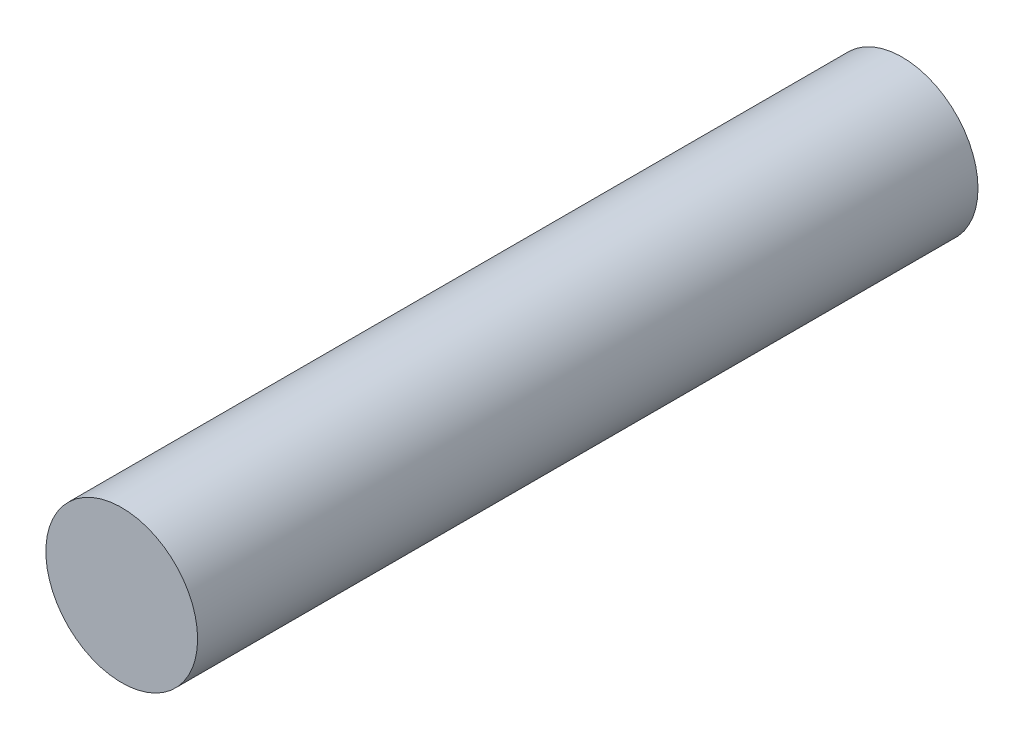
ISO-10303-21;
HEADER;
FILE_DESCRIPTION(('STEP AP214'),'2;1');
FILE_NAME('part.step','',(''),(''),'','','');
FILE_SCHEMA(('AUTOMOTIVE_DESIGN { 1 0 10303 214 1 1 1 1 }'));
ENDSEC;
DATA;
#1=APPLICATION_CONTEXT('core data for automotive mechanical design processes');
#2=APPLICATION_PROTOCOL_DEFINITION('international standard','automotive_design',2000,#1);
#3=PRODUCT_CONTEXT('',#1,'mechanical');
#4=PRODUCT('Part','Part','',(#3));
#5=PRODUCT_RELATED_PRODUCT_CATEGORY('part','',(#4));
#6=PRODUCT_DEFINITION_FORMATION('','',#4);
#7=PRODUCT_DEFINITION_CONTEXT('part definition',#1,'design');
#8=PRODUCT_DEFINITION('design','',#6,#7);
#9=PRODUCT_DEFINITION_SHAPE('','',#8);
#10=(LENGTH_UNIT() NAMED_UNIT(*) SI_UNIT(.MILLI.,.METRE.));
#11=(NAMED_UNIT(*) PLANE_ANGLE_UNIT() SI_UNIT($,.RADIAN.));
#12=(NAMED_UNIT(*) SI_UNIT($,.STERADIAN.) SOLID_ANGLE_UNIT());
#13=UNCERTAINTY_MEASURE_WITH_UNIT(LENGTH_MEASURE(1.E-05),#10,'distance_accuracy_value','');
#14=(GEOMETRIC_REPRESENTATION_CONTEXT(3) GLOBAL_UNCERTAINTY_ASSIGNED_CONTEXT((#13)) GLOBAL_UNIT_ASSIGNED_CONTEXT((#10,
#11,#12)) REPRESENTATION_CONTEXT('',''));
#15=CARTESIAN_POINT('',(0.,0.,0.));
#16=DIRECTION('',(0.,0.,1.));
#17=DIRECTION('',(1.,0.,0.));
#18=AXIS2_PLACEMENT_3D('',#15,#16,#17);
#19=CARTESIAN_POINT('',(0.,0.,36.));
#20=DIRECTION('',(0.,0.,-1.));
#21=DIRECTION('',(-1.,0.,0.));
#22=AXIS2_PLACEMENT_3D('',#19,#20,#21);
#23=CYLINDRICAL_SURFACE('',#22,3.5);
#24=CARTESIAN_POINT('',(0.,0.,36.));
#25=DIRECTION('',(0.,0.,1.));
#26=DIRECTION('',(1.,0.,0.));
#27=AXIS2_PLACEMENT_3D('',#24,#25,#26);
#28=CIRCLE('',#27,3.5);
#29=CARTESIAN_POINT('',(3.5,0.,36.));
#30=VERTEX_POINT('',#29);
#31=EDGE_CURVE('E10',#30,#30,#28,.T.);
#32=ORIENTED_EDGE('',*,*,#31,.F.);
#33=EDGE_LOOP('',(#32));
#34=FACE_BOUND('',#33,.T.);
#35=CARTESIAN_POINT('',(0.,0.,0.));
#36=DIRECTION('',(0.,0.,1.));
#37=DIRECTION('',(1.,0.,0.));
#38=AXIS2_PLACEMENT_3D('',#35,#36,#37);
#39=CIRCLE('',#38,3.5);
#40=CARTESIAN_POINT('',(3.5,0.,0.));
#41=VERTEX_POINT('',#40);
#42=EDGE_CURVE('E40',#41,#41,#39,.T.);
#43=ORIENTED_EDGE('',*,*,#42,.T.);
#44=EDGE_LOOP('',(#43));
#45=FACE_BOUND('',#44,.T.);
#46=ADVANCED_FACE('F37',(#34,#45),#23,.T.);
#47=CARTESIAN_POINT('',(0.,0.,36.));
#48=DIRECTION('',(0.,0.,1.));
#49=DIRECTION('',(1.,0.,0.));
#50=AXIS2_PLACEMENT_3D('',#47,#48,#49);
#51=PLANE('',#50);
#52=ORIENTED_EDGE('',*,*,#31,.T.);
#53=EDGE_LOOP('',(#52));
#54=FACE_BOUND('',#53,.T.);
#55=ADVANCED_FACE('F54',(#54),#51,.T.);
#56=CARTESIAN_POINT('',(0.,0.,0.));
#57=DIRECTION('',(0.,0.,1.));
#58=DIRECTION('',(1.,0.,0.));
#59=AXIS2_PLACEMENT_3D('',#56,#57,#58);
#60=PLANE('',#59);
#61=ORIENTED_EDGE('',*,*,#42,.F.);
#62=EDGE_LOOP('',(#61));
#63=FACE_BOUND('',#62,.T.);
#64=ADVANCED_FACE('F52',(#63),#60,.F.);
#65=CLOSED_SHELL('',(#46,#55,#64));
#66=MANIFOLD_SOLID_BREP('B2',#65);
#67=ADVANCED_BREP_SHAPE_REPRESENTATION('',(#18,#66),#14);
#68=SHAPE_DEFINITION_REPRESENTATION(#9,#67);
ENDSEC;
END-ISO-10303-21;
